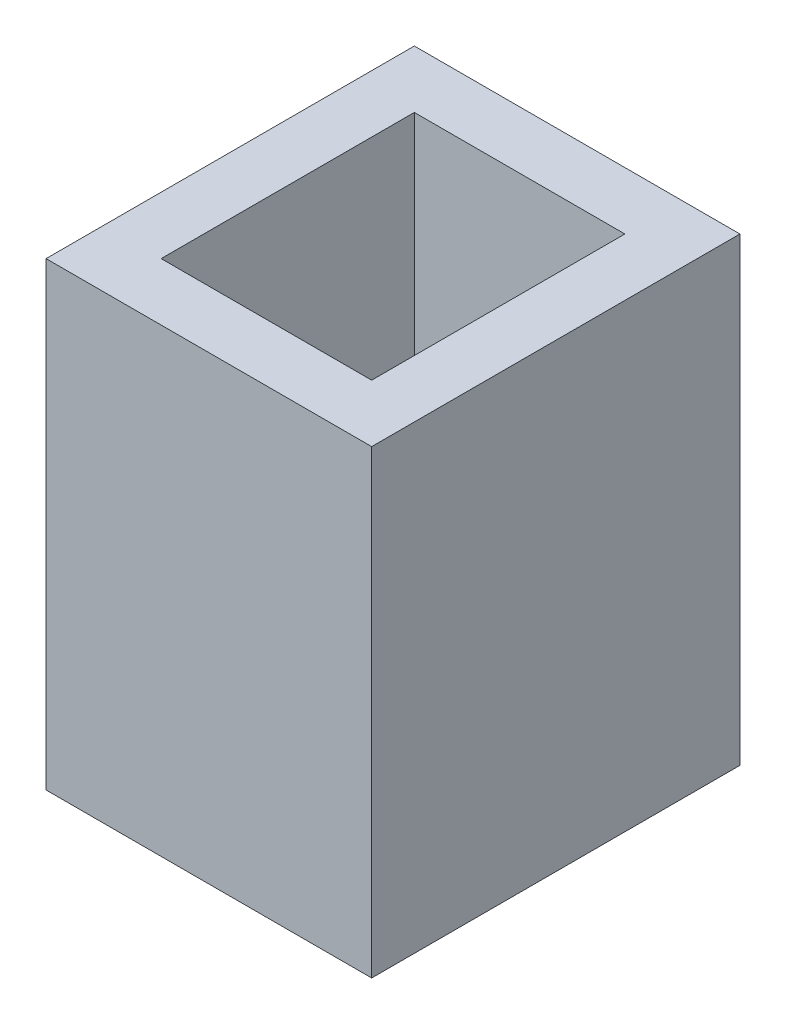
ISO-10303-21;
HEADER;
FILE_DESCRIPTION(('STEP AP214'),'2;1');
FILE_NAME('part.step','',(''),(''),'','','');
FILE_SCHEMA(('AUTOMOTIVE_DESIGN { 1 0 10303 214 1 1 1 1 }'));
ENDSEC;
DATA;
#1=APPLICATION_CONTEXT('core data for automotive mechanical design processes');
#2=APPLICATION_PROTOCOL_DEFINITION('international standard','automotive_design',2000,#1);
#3=PRODUCT_CONTEXT('',#1,'mechanical');
#4=PRODUCT('Part','Part','',(#3));
#5=PRODUCT_RELATED_PRODUCT_CATEGORY('part','',(#4));
#6=PRODUCT_DEFINITION_FORMATION('','',#4);
#7=PRODUCT_DEFINITION_CONTEXT('part definition',#1,'design');
#8=PRODUCT_DEFINITION('design','',#6,#7);
#9=PRODUCT_DEFINITION_SHAPE('','',#8);
#10=(LENGTH_UNIT() NAMED_UNIT(*) SI_UNIT(.MILLI.,.METRE.));
#11=(NAMED_UNIT(*) PLANE_ANGLE_UNIT() SI_UNIT($,.RADIAN.));
#12=(NAMED_UNIT(*) SI_UNIT($,.STERADIAN.) SOLID_ANGLE_UNIT());
#13=UNCERTAINTY_MEASURE_WITH_UNIT(LENGTH_MEASURE(1.E-05),#10,'distance_accuracy_value','');
#14=(GEOMETRIC_REPRESENTATION_CONTEXT(3) GLOBAL_UNCERTAINTY_ASSIGNED_CONTEXT((#13)) GLOBAL_UNIT_ASSIGNED_CONTEXT((#10,
#11,#12)) REPRESENTATION_CONTEXT('',''));
#15=CARTESIAN_POINT('',(0.,0.,0.));
#16=DIRECTION('',(0.,0.,1.));
#17=DIRECTION('',(1.,0.,0.));
#18=AXIS2_PLACEMENT_3D('',#15,#16,#17);
#19=CARTESIAN_POINT('',(0.,25.4,0.));
#20=DIRECTION('',(0.,-1.,0.));
#21=DIRECTION('',(0.,0.,-1.));
#22=AXIS2_PLACEMENT_3D('',#19,#20,#21);
#23=PLANE('',#22);
#24=DIRECTION('',(0.,0.,-1.));
#25=VECTOR('',#24,1.);
#26=CARTESIAN_POINT('',(8.98525,25.4,10.16254));
#27=LINE('',#26,#25);
#28=CARTESIAN_POINT('',(8.98525,25.4,10.16254));
#29=VERTEX_POINT('',#28);
#30=CARTESIAN_POINT('',(8.98525,25.4,-10.16254));
#31=VERTEX_POINT('',#30);
#32=EDGE_CURVE('E136',#29,#31,#27,.T.);
#33=ORIENTED_EDGE('',*,*,#32,.T.);
#34=DIRECTION('',(-1.,0.,0.));
#35=VECTOR('',#34,1.);
#36=CARTESIAN_POINT('',(-8.98525,25.4,-10.16254));
#37=LINE('',#36,#35);
#38=CARTESIAN_POINT('',(-8.98525,25.4,-10.16254));
#39=VERTEX_POINT('',#38);
#40=EDGE_CURVE('E139',#31,#39,#37,.T.);
#41=ORIENTED_EDGE('',*,*,#40,.T.);
#42=DIRECTION('',(0.,0.,1.));
#43=VECTOR('',#42,1.);
#44=CARTESIAN_POINT('',(-8.98525,25.4,10.16254));
#45=LINE('',#44,#43);
#46=CARTESIAN_POINT('',(-8.98525,25.4,10.16254));
#47=VERTEX_POINT('',#46);
#48=EDGE_CURVE('E142',#39,#47,#45,.T.);
#49=ORIENTED_EDGE('',*,*,#48,.T.);
#50=DIRECTION('',(1.,0.,0.));
#51=VECTOR('',#50,1.);
#52=CARTESIAN_POINT('',(-8.98525,25.4,10.16254));
#53=LINE('',#52,#51);
#54=EDGE_CURVE('E144',#47,#29,#53,.T.);
#55=ORIENTED_EDGE('',*,*,#54,.T.);
#56=EDGE_LOOP('',(#33,#41,#49,#55));
#57=FACE_BOUND('',#56,.T.);
#58=DIRECTION('',(0.,0.,-1.));
#59=VECTOR('',#58,1.);
#60=CARTESIAN_POINT('',(5.81025,25.4,6.98754));
#61=LINE('',#60,#59);
#62=CARTESIAN_POINT('',(5.81025,25.4,6.98754));
#63=VERTEX_POINT('',#62);
#64=CARTESIAN_POINT('',(5.81025,25.4,-6.98754));
#65=VERTEX_POINT('',#64);
#66=EDGE_CURVE('E100',#63,#65,#61,.T.);
#67=ORIENTED_EDGE('',*,*,#66,.F.);
#68=DIRECTION('',(1.,0.,0.));
#69=VECTOR('',#68,1.);
#70=CARTESIAN_POINT('',(-5.81025,25.4,6.98754));
#71=LINE('',#70,#69);
#72=CARTESIAN_POINT('',(-5.81025,25.4,6.98754));
#73=VERTEX_POINT('',#72);
#74=EDGE_CURVE('E122',#73,#63,#71,.T.);
#75=ORIENTED_EDGE('',*,*,#74,.F.);
#76=DIRECTION('',(0.,0.,1.));
#77=VECTOR('',#76,1.);
#78=CARTESIAN_POINT('',(-5.81025,25.4,6.98754));
#79=LINE('',#78,#77);
#80=CARTESIAN_POINT('',(-5.81025,25.4,-6.98754));
#81=VERTEX_POINT('',#80);
#82=EDGE_CURVE('E120',#81,#73,#79,.T.);
#83=ORIENTED_EDGE('',*,*,#82,.F.);
#84=DIRECTION('',(-1.,0.,0.));
#85=VECTOR('',#84,1.);
#86=CARTESIAN_POINT('',(-5.81025,25.4,-6.98754));
#87=LINE('',#86,#85);
#88=EDGE_CURVE('E108',#65,#81,#87,.T.);
#89=ORIENTED_EDGE('',*,*,#88,.F.);
#90=EDGE_LOOP('',(#67,#75,#83,#89));
#91=FACE_BOUND('',#90,.T.);
#92=ADVANCED_FACE('F35',(#57,#91),#23,.F.);
#93=CARTESIAN_POINT('',(0.,0.,0.));
#94=DIRECTION('',(0.,-1.,0.));
#95=DIRECTION('',(0.,0.,-1.));
#96=AXIS2_PLACEMENT_3D('',#93,#94,#95);
#97=PLANE('',#96);
#98=DIRECTION('',(0.,0.,-1.));
#99=VECTOR('',#98,1.);
#100=CARTESIAN_POINT('',(8.98525,0.,10.16254));
#101=LINE('',#100,#99);
#102=CARTESIAN_POINT('',(8.98525,0.,10.16254));
#103=VERTEX_POINT('',#102);
#104=CARTESIAN_POINT('',(8.98525,0.,-10.16254));
#105=VERTEX_POINT('',#104);
#106=EDGE_CURVE('E116',#103,#105,#101,.T.);
#107=ORIENTED_EDGE('',*,*,#106,.F.);
#108=DIRECTION('',(1.,0.,0.));
#109=VECTOR('',#108,1.);
#110=CARTESIAN_POINT('',(-8.98525,0.,10.16254));
#111=LINE('',#110,#109);
#112=CARTESIAN_POINT('',(-8.98525,0.,10.16254));
#113=VERTEX_POINT('',#112);
#114=EDGE_CURVE('E140',#113,#103,#111,.T.);
#115=ORIENTED_EDGE('',*,*,#114,.F.);
#116=DIRECTION('',(0.,0.,1.));
#117=VECTOR('',#116,1.);
#118=CARTESIAN_POINT('',(-8.98525,0.,10.16254));
#119=LINE('',#118,#117);
#120=CARTESIAN_POINT('',(-8.98525,0.,-10.16254));
#121=VERTEX_POINT('',#120);
#122=EDGE_CURVE('E151',#121,#113,#119,.T.);
#123=ORIENTED_EDGE('',*,*,#122,.F.);
#124=DIRECTION('',(-1.,0.,0.));
#125=VECTOR('',#124,1.);
#126=CARTESIAN_POINT('',(-8.98525,0.,-10.16254));
#127=LINE('',#126,#125);
#128=EDGE_CURVE('E149',#105,#121,#127,.T.);
#129=ORIENTED_EDGE('',*,*,#128,.F.);
#130=EDGE_LOOP('',(#107,#115,#123,#129));
#131=FACE_BOUND('',#130,.T.);
#132=DIRECTION('',(1.,0.,0.));
#133=VECTOR('',#132,1.);
#134=CARTESIAN_POINT('',(-5.81025,0.,6.98754));
#135=LINE('',#134,#133);
#136=CARTESIAN_POINT('',(-5.81025,0.,6.98754));
#137=VERTEX_POINT('',#136);
#138=CARTESIAN_POINT('',(5.81025,0.,6.98754));
#139=VERTEX_POINT('',#138);
#140=EDGE_CURVE('E109',#137,#139,#135,.T.);
#141=ORIENTED_EDGE('',*,*,#140,.T.);
#142=DIRECTION('',(0.,0.,-1.));
#143=VECTOR('',#142,1.);
#144=CARTESIAN_POINT('',(5.81025,0.,6.98754));
#145=LINE('',#144,#143);
#146=CARTESIAN_POINT('',(5.81025,0.,-6.98754));
#147=VERTEX_POINT('',#146);
#148=EDGE_CURVE('E58',#139,#147,#145,.T.);
#149=ORIENTED_EDGE('',*,*,#148,.T.);
#150=DIRECTION('',(-1.,0.,0.));
#151=VECTOR('',#150,1.);
#152=CARTESIAN_POINT('',(-5.81025,0.,-6.98754));
#153=LINE('',#152,#151);
#154=CARTESIAN_POINT('',(-5.81025,0.,-6.98754));
#155=VERTEX_POINT('',#154);
#156=EDGE_CURVE('E115',#147,#155,#153,.T.);
#157=ORIENTED_EDGE('',*,*,#156,.T.);
#158=DIRECTION('',(0.,0.,1.));
#159=VECTOR('',#158,1.);
#160=CARTESIAN_POINT('',(-5.81025,0.,6.98754));
#161=LINE('',#160,#159);
#162=EDGE_CURVE('E128',#155,#137,#161,.T.);
#163=ORIENTED_EDGE('',*,*,#162,.T.);
#164=EDGE_LOOP('',(#141,#149,#157,#163));
#165=FACE_BOUND('',#164,.T.);
#166=ADVANCED_FACE('F169',(#131,#165),#97,.T.);
#167=CARTESIAN_POINT('',(8.98525,25.4,10.16254));
#168=DIRECTION('',(-1.,0.,0.));
#169=DIRECTION('',(0.,0.,1.));
#170=AXIS2_PLACEMENT_3D('',#167,#168,#169);
#171=PLANE('',#170);
#172=ORIENTED_EDGE('',*,*,#106,.T.);
#173=DIRECTION('',(0.,-1.,0.));
#174=VECTOR('',#173,1.);
#175=CARTESIAN_POINT('',(8.98525,25.4,-10.16254));
#176=LINE('',#175,#174);
#177=EDGE_CURVE('E11',#31,#105,#176,.T.);
#178=ORIENTED_EDGE('',*,*,#177,.F.);
#179=ORIENTED_EDGE('',*,*,#32,.F.);
#180=DIRECTION('',(0.,-1.,0.));
#181=VECTOR('',#180,1.);
#182=CARTESIAN_POINT('',(8.98525,25.4,10.16254));
#183=LINE('',#182,#181);
#184=EDGE_CURVE('E146',#29,#103,#183,.T.);
#185=ORIENTED_EDGE('',*,*,#184,.T.);
#186=EDGE_LOOP('',(#172,#178,#179,#185));
#187=FACE_BOUND('',#186,.T.);
#188=ADVANCED_FACE('F37',(#187),#171,.F.);
#189=CARTESIAN_POINT('',(-8.98525,25.4,-10.16254));
#190=DIRECTION('',(0.,0.,1.));
#191=DIRECTION('',(1.,0.,0.));
#192=AXIS2_PLACEMENT_3D('',#189,#190,#191);
#193=PLANE('',#192);
#194=ORIENTED_EDGE('',*,*,#128,.T.);
#195=DIRECTION('',(0.,-1.,0.));
#196=VECTOR('',#195,1.);
#197=CARTESIAN_POINT('',(-8.98525,25.4,-10.16254));
#198=LINE('',#197,#196);
#199=EDGE_CURVE('E43',#39,#121,#198,.T.);
#200=ORIENTED_EDGE('',*,*,#199,.F.);
#201=ORIENTED_EDGE('',*,*,#40,.F.);
#202=ORIENTED_EDGE('',*,*,#177,.T.);
#203=EDGE_LOOP('',(#194,#200,#201,#202));
#204=FACE_BOUND('',#203,.T.);
#205=ADVANCED_FACE('F179',(#204),#193,.F.);
#206=CARTESIAN_POINT('',(-8.98525,25.4,10.16254));
#207=DIRECTION('',(1.,0.,0.));
#208=DIRECTION('',(0.,0.,-1.));
#209=AXIS2_PLACEMENT_3D('',#206,#207,#208);
#210=PLANE('',#209);
#211=ORIENTED_EDGE('',*,*,#122,.T.);
#212=DIRECTION('',(0.,-1.,0.));
#213=VECTOR('',#212,1.);
#214=CARTESIAN_POINT('',(-8.98525,25.4,10.16254));
#215=LINE('',#214,#213);
#216=EDGE_CURVE('E156',#47,#113,#215,.T.);
#217=ORIENTED_EDGE('',*,*,#216,.F.);
#218=ORIENTED_EDGE('',*,*,#48,.F.);
#219=ORIENTED_EDGE('',*,*,#199,.T.);
#220=EDGE_LOOP('',(#211,#217,#218,#219));
#221=FACE_BOUND('',#220,.T.);
#222=ADVANCED_FACE('F163',(#221),#210,.F.);
#223=CARTESIAN_POINT('',(-8.98525,25.4,10.16254));
#224=DIRECTION('',(0.,0.,-1.));
#225=DIRECTION('',(-1.,0.,0.));
#226=AXIS2_PLACEMENT_3D('',#223,#224,#225);
#227=PLANE('',#226);
#228=ORIENTED_EDGE('',*,*,#114,.T.);
#229=ORIENTED_EDGE('',*,*,#184,.F.);
#230=ORIENTED_EDGE('',*,*,#54,.F.);
#231=ORIENTED_EDGE('',*,*,#216,.T.);
#232=EDGE_LOOP('',(#228,#229,#230,#231));
#233=FACE_BOUND('',#232,.T.);
#234=ADVANCED_FACE('F173',(#233),#227,.F.);
#235=CARTESIAN_POINT('',(5.81025,25.4,6.98754));
#236=DIRECTION('',(-1.,0.,0.));
#237=DIRECTION('',(0.,0.,1.));
#238=AXIS2_PLACEMENT_3D('',#235,#236,#237);
#239=PLANE('',#238);
#240=ORIENTED_EDGE('',*,*,#148,.F.);
#241=DIRECTION('',(0.,-1.,0.));
#242=VECTOR('',#241,1.);
#243=CARTESIAN_POINT('',(5.81025,25.4,6.98754));
#244=LINE('',#243,#242);
#245=EDGE_CURVE('E104',#63,#139,#244,.T.);
#246=ORIENTED_EDGE('',*,*,#245,.F.);
#247=ORIENTED_EDGE('',*,*,#66,.T.);
#248=DIRECTION('',(0.,-1.,0.));
#249=VECTOR('',#248,1.);
#250=CARTESIAN_POINT('',(5.81025,25.4,-6.98754));
#251=LINE('',#250,#249);
#252=EDGE_CURVE('E103',#65,#147,#251,.T.);
#253=ORIENTED_EDGE('',*,*,#252,.T.);
#254=EDGE_LOOP('',(#240,#246,#247,#253));
#255=FACE_BOUND('',#254,.T.);
#256=ADVANCED_FACE('F102',(#255),#239,.T.);
#257=CARTESIAN_POINT('',(-5.81025,25.4,-6.98754));
#258=DIRECTION('',(0.,0.,1.));
#259=DIRECTION('',(1.,0.,0.));
#260=AXIS2_PLACEMENT_3D('',#257,#258,#259);
#261=PLANE('',#260);
#262=ORIENTED_EDGE('',*,*,#156,.F.);
#263=ORIENTED_EDGE('',*,*,#252,.F.);
#264=ORIENTED_EDGE('',*,*,#88,.T.);
#265=DIRECTION('',(0.,-1.,0.));
#266=VECTOR('',#265,1.);
#267=CARTESIAN_POINT('',(-5.81025,25.4,-6.98754));
#268=LINE('',#267,#266);
#269=EDGE_CURVE('E117',#81,#155,#268,.T.);
#270=ORIENTED_EDGE('',*,*,#269,.T.);
#271=EDGE_LOOP('',(#262,#263,#264,#270));
#272=FACE_BOUND('',#271,.T.);
#273=ADVANCED_FACE('F112',(#272),#261,.T.);
#274=CARTESIAN_POINT('',(-5.81025,25.4,6.98754));
#275=DIRECTION('',(1.,0.,0.));
#276=DIRECTION('',(0.,0.,-1.));
#277=AXIS2_PLACEMENT_3D('',#274,#275,#276);
#278=PLANE('',#277);
#279=ORIENTED_EDGE('',*,*,#162,.F.);
#280=ORIENTED_EDGE('',*,*,#269,.F.);
#281=ORIENTED_EDGE('',*,*,#82,.T.);
#282=DIRECTION('',(0.,-1.,0.));
#283=VECTOR('',#282,1.);
#284=CARTESIAN_POINT('',(-5.81025,25.4,6.98754));
#285=LINE('',#284,#283);
#286=EDGE_CURVE('E50',#73,#137,#285,.T.);
#287=ORIENTED_EDGE('',*,*,#286,.T.);
#288=EDGE_LOOP('',(#279,#280,#281,#287));
#289=FACE_BOUND('',#288,.T.);
#290=ADVANCED_FACE('F202',(#289),#278,.T.);
#291=CARTESIAN_POINT('',(-5.81025,25.4,6.98754));
#292=DIRECTION('',(0.,0.,-1.));
#293=DIRECTION('',(-1.,0.,0.));
#294=AXIS2_PLACEMENT_3D('',#291,#292,#293);
#295=PLANE('',#294);
#296=ORIENTED_EDGE('',*,*,#140,.F.);
#297=ORIENTED_EDGE('',*,*,#286,.F.);
#298=ORIENTED_EDGE('',*,*,#74,.T.);
#299=ORIENTED_EDGE('',*,*,#245,.T.);
#300=EDGE_LOOP('',(#296,#297,#298,#299));
#301=FACE_BOUND('',#300,.T.);
#302=ADVANCED_FACE('F206',(#301),#295,.T.);
#303=CLOSED_SHELL('',(#92,#166,#188,#205,#222,#234,#256,#273,#290,#302));
#304=MANIFOLD_SOLID_BREP('B2',#303);
#305=ADVANCED_BREP_SHAPE_REPRESENTATION('',(#18,#304),#14);
#306=SHAPE_DEFINITION_REPRESENTATION(#9,#305);
ENDSEC;
END-ISO-10303-21;
